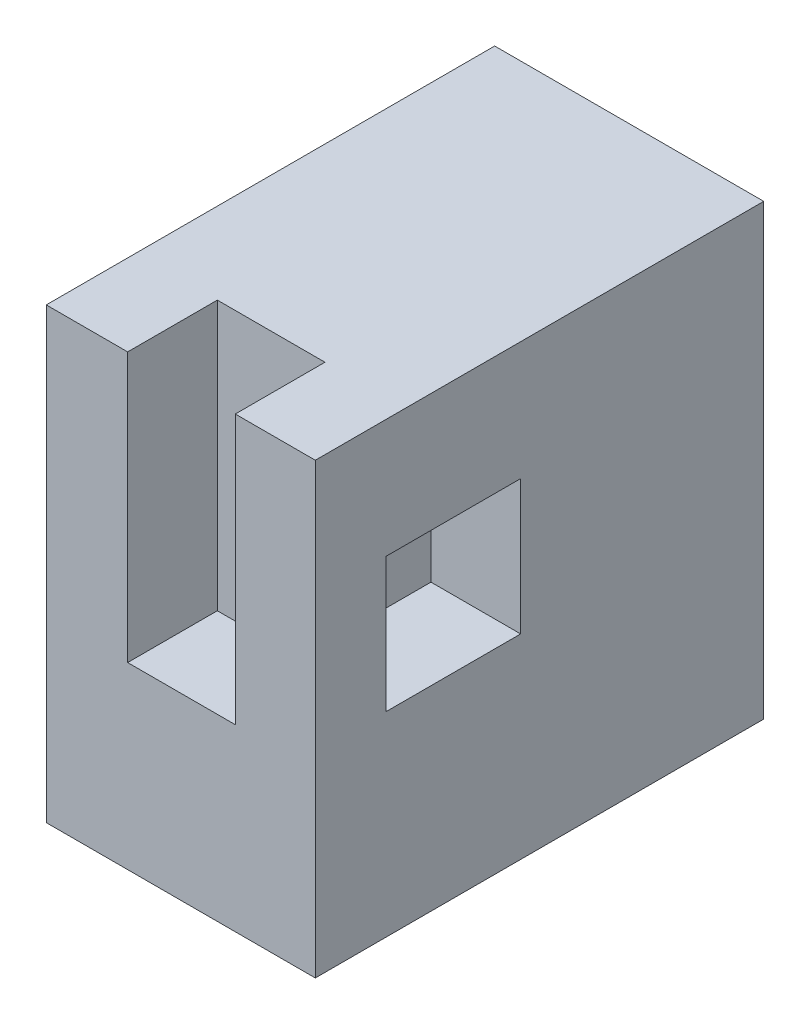
ISO-10303-21;
HEADER;
FILE_DESCRIPTION(('STEP AP214'),'2;1');
FILE_NAME('part.step','',(''),(''),'','','');
FILE_SCHEMA(('AUTOMOTIVE_DESIGN { 1 0 10303 214 1 1 1 1 }'));
ENDSEC;
DATA;
#1=APPLICATION_CONTEXT('core data for automotive mechanical design processes');
#2=APPLICATION_PROTOCOL_DEFINITION('international standard','automotive_design',2000,#1);
#3=PRODUCT_CONTEXT('',#1,'mechanical');
#4=PRODUCT('Part','Part','',(#3));
#5=PRODUCT_RELATED_PRODUCT_CATEGORY('part','',(#4));
#6=PRODUCT_DEFINITION_FORMATION('','',#4);
#7=PRODUCT_DEFINITION_CONTEXT('part definition',#1,'design');
#8=PRODUCT_DEFINITION('design','',#6,#7);
#9=PRODUCT_DEFINITION_SHAPE('','',#8);
#10=(LENGTH_UNIT() NAMED_UNIT(*) SI_UNIT(.MILLI.,.METRE.));
#11=(NAMED_UNIT(*) PLANE_ANGLE_UNIT() SI_UNIT($,.RADIAN.));
#12=(NAMED_UNIT(*) SI_UNIT($,.STERADIAN.) SOLID_ANGLE_UNIT());
#13=UNCERTAINTY_MEASURE_WITH_UNIT(LENGTH_MEASURE(1.E-05),#10,'distance_accuracy_value','');
#14=(GEOMETRIC_REPRESENTATION_CONTEXT(3) GLOBAL_UNCERTAINTY_ASSIGNED_CONTEXT((#13)) GLOBAL_UNIT_ASSIGNED_CONTEXT((#10,
#11,#12)) REPRESENTATION_CONTEXT('',''));
#15=CARTESIAN_POINT('',(0.,0.,0.));
#16=DIRECTION('',(0.,0.,1.));
#17=DIRECTION('',(1.,0.,0.));
#18=AXIS2_PLACEMENT_3D('',#15,#16,#17);
#19=CARTESIAN_POINT('',(-77.2402504992883,9.08860684769774,50.));
#20=DIRECTION('',(1.,0.,0.));
#21=DIRECTION('',(0.,1.,0.));
#22=AXIS2_PLACEMENT_3D('',#19,#20,#21);
#23=PLANE('',#22);
#24=DIRECTION('',(0.,-1.,0.));
#25=VECTOR('',#24,1.);
#26=CARTESIAN_POINT('',(-77.2402504992883,9.08860684769774,0.));
#27=LINE('',#26,#25);
#28=CARTESIAN_POINT('',(-77.2402504992883,9.08860684769774,0.));
#29=VERTEX_POINT('',#28);
#30=CARTESIAN_POINT('',(-77.2402504992883,-40.9113931523023,0.));
#31=VERTEX_POINT('',#30);
#32=EDGE_CURVE('E198',#29,#31,#27,.T.);
#33=ORIENTED_EDGE('',*,*,#32,.T.);
#34=DIRECTION('',(0.,0.,-1.));
#35=VECTOR('',#34,1.);
#36=CARTESIAN_POINT('',(-77.2402504992883,-40.9113931523023,50.));
#37=LINE('',#36,#35);
#38=CARTESIAN_POINT('',(-77.2402504992883,-40.9113931523023,50.));
#39=VERTEX_POINT('',#38);
#40=EDGE_CURVE('E234',#39,#31,#37,.T.);
#41=ORIENTED_EDGE('',*,*,#40,.F.);
#42=DIRECTION('',(0.,-1.,0.));
#43=VECTOR('',#42,1.);
#44=CARTESIAN_POINT('',(-77.2402504992883,9.08860684769774,50.));
#45=LINE('',#44,#43);
#46=CARTESIAN_POINT('',(-77.2402504992883,9.08860684769774,50.));
#47=VERTEX_POINT('',#46);
#48=EDGE_CURVE('E206',#47,#39,#45,.T.);
#49=ORIENTED_EDGE('',*,*,#48,.F.);
#50=DIRECTION('',(0.,0.,-1.));
#51=VECTOR('',#50,1.);
#52=CARTESIAN_POINT('',(-77.2402504992883,9.08860684769774,50.));
#53=LINE('',#52,#51);
#54=EDGE_CURVE('E218',#47,#29,#53,.T.);
#55=ORIENTED_EDGE('',*,*,#54,.T.);
#56=EDGE_LOOP('',(#33,#41,#49,#55));
#57=FACE_BOUND('',#56,.T.);
#58=ADVANCED_FACE('F33',(#57),#23,.F.);
#59=CARTESIAN_POINT('',(-77.2402504992883,-40.9113931523023,50.));
#60=DIRECTION('',(0.,1.,0.));
#61=DIRECTION('',(0.,0.,1.));
#62=AXIS2_PLACEMENT_3D('',#59,#60,#61);
#63=PLANE('',#62);
#64=DIRECTION('',(1.,0.,0.));
#65=VECTOR('',#64,1.);
#66=CARTESIAN_POINT('',(-77.2402504992883,-40.9113931523023,0.));
#67=LINE('',#66,#65);
#68=CARTESIAN_POINT('',(-47.2402504992883,-40.9113931523023,0.));
#69=VERTEX_POINT('',#68);
#70=EDGE_CURVE('E221',#31,#69,#67,.T.);
#71=ORIENTED_EDGE('',*,*,#70,.T.);
#72=DIRECTION('',(0.,0.,-1.));
#73=VECTOR('',#72,1.);
#74=CARTESIAN_POINT('',(-47.2402504992883,-40.9113931523023,50.));
#75=LINE('',#74,#73);
#76=CARTESIAN_POINT('',(-47.2402504992883,-40.9113931523023,50.));
#77=VERTEX_POINT('',#76);
#78=EDGE_CURVE('E231',#77,#69,#75,.T.);
#79=ORIENTED_EDGE('',*,*,#78,.F.);
#80=DIRECTION('',(1.,0.,0.));
#81=VECTOR('',#80,1.);
#82=CARTESIAN_POINT('',(-77.2402504992883,-40.9113931523023,50.));
#83=LINE('',#82,#81);
#84=EDGE_CURVE('E209',#39,#77,#83,.T.);
#85=ORIENTED_EDGE('',*,*,#84,.F.);
#86=ORIENTED_EDGE('',*,*,#40,.T.);
#87=EDGE_LOOP('',(#71,#79,#85,#86));
#88=FACE_BOUND('',#87,.T.);
#89=ADVANCED_FACE('F256',(#88),#63,.F.);
#90=CARTESIAN_POINT('',(-47.2402504992883,9.08860684769774,50.));
#91=DIRECTION('',(-1.,0.,0.));
#92=DIRECTION('',(0.,-1.,0.));
#93=AXIS2_PLACEMENT_3D('',#90,#91,#92);
#94=PLANE('',#93);
#95=DIRECTION('',(0.,0.,-1.));
#96=VECTOR('',#95,1.);
#97=CARTESIAN_POINT('',(-47.2402504992883,-19.1331208991699,42.1045266958799));
#98=LINE('',#97,#96);
#99=CARTESIAN_POINT('',(-47.2402504992883,-19.1331208991699,42.1045266958799));
#100=VERTEX_POINT('',#99);
#101=CARTESIAN_POINT('',(-47.2402504992883,-19.1331208991699,27.1045266958799));
#102=VERTEX_POINT('',#101);
#103=EDGE_CURVE('E148',#100,#102,#98,.T.);
#104=ORIENTED_EDGE('',*,*,#103,.F.);
#105=DIRECTION('',(0.,-1.,0.));
#106=VECTOR('',#105,1.);
#107=CARTESIAN_POINT('',(-47.2402504992883,-19.1331208991699,42.1045266958799));
#108=LINE('',#107,#106);
#109=CARTESIAN_POINT('',(-47.2402504992883,-4.13312089916987,42.1045266958799));
#110=VERTEX_POINT('',#109);
#111=EDGE_CURVE('E47',#110,#100,#108,.T.);
#112=ORIENTED_EDGE('',*,*,#111,.F.);
#113=DIRECTION('',(0.,0.,1.));
#114=VECTOR('',#113,1.);
#115=CARTESIAN_POINT('',(-47.2402504992883,-4.13312089916987,42.1045266958799));
#116=LINE('',#115,#114);
#117=CARTESIAN_POINT('',(-47.2402504992883,-4.13312089916987,27.1045266958799));
#118=VERTEX_POINT('',#117);
#119=EDGE_CURVE('E142',#118,#110,#116,.T.);
#120=ORIENTED_EDGE('',*,*,#119,.F.);
#121=DIRECTION('',(0.,1.,0.));
#122=VECTOR('',#121,1.);
#123=CARTESIAN_POINT('',(-47.2402504992883,-19.1331208991699,27.1045266958799));
#124=LINE('',#123,#122);
#125=EDGE_CURVE('E161',#102,#118,#124,.T.);
#126=ORIENTED_EDGE('',*,*,#125,.F.);
#127=EDGE_LOOP('',(#104,#112,#120,#126));
#128=FACE_BOUND('',#127,.T.);
#129=DIRECTION('',(0.,1.,0.));
#130=VECTOR('',#129,1.);
#131=CARTESIAN_POINT('',(-47.2402504992883,9.08860684769774,0.));
#132=LINE('',#131,#130);
#133=CARTESIAN_POINT('',(-47.2402504992883,9.08860684769774,0.));
#134=VERTEX_POINT('',#133);
#135=EDGE_CURVE('E223',#69,#134,#132,.T.);
#136=ORIENTED_EDGE('',*,*,#135,.T.);
#137=DIRECTION('',(0.,0.,-1.));
#138=VECTOR('',#137,1.);
#139=CARTESIAN_POINT('',(-47.2402504992883,9.08860684769774,50.));
#140=LINE('',#139,#138);
#141=CARTESIAN_POINT('',(-47.2402504992883,9.08860684769774,50.));
#142=VERTEX_POINT('',#141);
#143=EDGE_CURVE('E228',#142,#134,#140,.T.);
#144=ORIENTED_EDGE('',*,*,#143,.F.);
#145=DIRECTION('',(0.,1.,0.));
#146=VECTOR('',#145,1.);
#147=CARTESIAN_POINT('',(-47.2402504992883,9.08860684769774,50.));
#148=LINE('',#147,#146);
#149=EDGE_CURVE('E212',#77,#142,#148,.T.);
#150=ORIENTED_EDGE('',*,*,#149,.F.);
#151=ORIENTED_EDGE('',*,*,#78,.T.);
#152=EDGE_LOOP('',(#136,#144,#150,#151));
#153=FACE_BOUND('',#152,.T.);
#154=ADVANCED_FACE('F252',(#128,#153),#94,.F.);
#155=CARTESIAN_POINT('',(-77.2402504992883,9.08860684769774,50.));
#156=DIRECTION('',(0.,-1.,0.));
#157=DIRECTION('',(0.,0.,-1.));
#158=AXIS2_PLACEMENT_3D('',#155,#156,#157);
#159=PLANE('',#158);
#160=DIRECTION('',(-1.,0.,0.));
#161=VECTOR('',#160,1.);
#162=CARTESIAN_POINT('',(-77.2402504992883,9.08860684769774,50.));
#163=LINE('',#162,#161);
#164=CARTESIAN_POINT('',(-68.1652595936839,9.08860684769774,50.));
#165=VERTEX_POINT('',#164);
#166=EDGE_CURVE('E214',#165,#47,#163,.T.);
#167=ORIENTED_EDGE('',*,*,#166,.F.);
#168=DIRECTION('',(0.,0.,1.));
#169=VECTOR('',#168,1.);
#170=CARTESIAN_POINT('',(-68.1652595936839,9.08860684769774,40.));
#171=LINE('',#170,#169);
#172=CARTESIAN_POINT('',(-68.1652595936839,9.08860684769774,40.));
#173=VERTEX_POINT('',#172);
#174=EDGE_CURVE('E196',#173,#165,#171,.T.);
#175=ORIENTED_EDGE('',*,*,#174,.F.);
#176=DIRECTION('',(-1.,0.,0.));
#177=VECTOR('',#176,1.);
#178=CARTESIAN_POINT('',(-68.1652595936839,9.08860684769774,40.));
#179=LINE('',#178,#177);
#180=CARTESIAN_POINT('',(-56.1652595936839,9.08860684769774,40.));
#181=VERTEX_POINT('',#180);
#182=EDGE_CURVE('E187',#181,#173,#179,.T.);
#183=ORIENTED_EDGE('',*,*,#182,.F.);
#184=DIRECTION('',(0.,0.,1.));
#185=VECTOR('',#184,1.);
#186=CARTESIAN_POINT('',(-56.1652595936839,9.08860684769774,40.));
#187=LINE('',#186,#185);
#188=CARTESIAN_POINT('',(-56.1652595936839,9.08860684769774,50.));
#189=VERTEX_POINT('',#188);
#190=EDGE_CURVE('E199',#181,#189,#187,.T.);
#191=ORIENTED_EDGE('',*,*,#190,.T.);
#192=EDGE_CURVE('E215',#142,#189,#163,.T.);
#193=ORIENTED_EDGE('',*,*,#192,.F.);
#194=ORIENTED_EDGE('',*,*,#143,.T.);
#195=DIRECTION('',(-1.,0.,0.));
#196=VECTOR('',#195,1.);
#197=CARTESIAN_POINT('',(-77.2402504992883,9.08860684769774,0.));
#198=LINE('',#197,#196);
#199=EDGE_CURVE('E210',#134,#29,#198,.T.);
#200=ORIENTED_EDGE('',*,*,#199,.T.);
#201=ORIENTED_EDGE('',*,*,#54,.F.);
#202=EDGE_LOOP('',(#167,#175,#183,#191,#193,#194,#200,#201));
#203=FACE_BOUND('',#202,.T.);
#204=ADVANCED_FACE('F255',(#203),#159,.F.);
#205=CARTESIAN_POINT('',(0.,0.,50.));
#206=DIRECTION('',(0.,0.,1.));
#207=DIRECTION('',(1.,0.,0.));
#208=AXIS2_PLACEMENT_3D('',#205,#206,#207);
#209=PLANE('',#208);
#210=DIRECTION('',(0.,-1.,0.));
#211=VECTOR('',#210,1.);
#212=CARTESIAN_POINT('',(-68.1652595936839,9.08860684769774,50.));
#213=LINE('',#212,#211);
#214=CARTESIAN_POINT('',(-68.1652595936839,-20.9113931523023,50.));
#215=VERTEX_POINT('',#214);
#216=EDGE_CURVE('E175',#165,#215,#213,.T.);
#217=ORIENTED_EDGE('',*,*,#216,.F.);
#218=ORIENTED_EDGE('',*,*,#166,.T.);
#219=ORIENTED_EDGE('',*,*,#48,.T.);
#220=ORIENTED_EDGE('',*,*,#84,.T.);
#221=ORIENTED_EDGE('',*,*,#149,.T.);
#222=ORIENTED_EDGE('',*,*,#192,.T.);
#223=DIRECTION('',(0.,1.,0.));
#224=VECTOR('',#223,1.);
#225=CARTESIAN_POINT('',(-56.1652595936839,9.08860684769774,50.));
#226=LINE('',#225,#224);
#227=CARTESIAN_POINT('',(-56.1652595936839,-20.9113931523023,50.));
#228=VERTEX_POINT('',#227);
#229=EDGE_CURVE('E180',#228,#189,#226,.T.);
#230=ORIENTED_EDGE('',*,*,#229,.F.);
#231=DIRECTION('',(1.,0.,0.));
#232=VECTOR('',#231,1.);
#233=CARTESIAN_POINT('',(-68.1652595936839,-20.9113931523023,50.));
#234=LINE('',#233,#232);
#235=EDGE_CURVE('E192',#215,#228,#234,.T.);
#236=ORIENTED_EDGE('',*,*,#235,.F.);
#237=EDGE_LOOP('',(#217,#218,#219,#220,#221,#222,#230,#236));
#238=FACE_BOUND('',#237,.T.);
#239=ADVANCED_FACE('F277',(#238),#209,.T.);
#240=CARTESIAN_POINT('',(0.,0.,0.));
#241=DIRECTION('',(0.,0.,1.));
#242=DIRECTION('',(1.,0.,0.));
#243=AXIS2_PLACEMENT_3D('',#240,#241,#242);
#244=PLANE('',#243);
#245=ORIENTED_EDGE('',*,*,#32,.F.);
#246=ORIENTED_EDGE('',*,*,#199,.F.);
#247=ORIENTED_EDGE('',*,*,#135,.F.);
#248=ORIENTED_EDGE('',*,*,#70,.F.);
#249=EDGE_LOOP('',(#245,#246,#247,#248));
#250=FACE_BOUND('',#249,.T.);
#251=ADVANCED_FACE('F269',(#250),#244,.F.);
#252=CARTESIAN_POINT('',(-68.1652595936839,9.08860684769774,40.));
#253=DIRECTION('',(-1.,0.,0.));
#254=DIRECTION('',(0.,0.,1.));
#255=AXIS2_PLACEMENT_3D('',#252,#253,#254);
#256=PLANE('',#255);
#257=ORIENTED_EDGE('',*,*,#216,.T.);
#258=DIRECTION('',(0.,0.,1.));
#259=VECTOR('',#258,1.);
#260=CARTESIAN_POINT('',(-68.1652595936839,-20.9113931523023,40.));
#261=LINE('',#260,#259);
#262=CARTESIAN_POINT('',(-68.1652595936839,-20.9113931523023,40.));
#263=VERTEX_POINT('',#262);
#264=EDGE_CURVE('E190',#263,#215,#261,.T.);
#265=ORIENTED_EDGE('',*,*,#264,.F.);
#266=DIRECTION('',(0.,-1.,0.));
#267=VECTOR('',#266,1.);
#268=CARTESIAN_POINT('',(-68.1652595936839,9.08860684769774,40.));
#269=LINE('',#268,#267);
#270=EDGE_CURVE('E176',#173,#263,#269,.T.);
#271=ORIENTED_EDGE('',*,*,#270,.F.);
#272=ORIENTED_EDGE('',*,*,#174,.T.);
#273=EDGE_LOOP('',(#257,#265,#271,#272));
#274=FACE_BOUND('',#273,.T.);
#275=ADVANCED_FACE('F281',(#274),#256,.F.);
#276=CARTESIAN_POINT('',(-56.1652595936839,9.08860684769774,40.));
#277=DIRECTION('',(1.,0.,0.));
#278=DIRECTION('',(0.,0.,-1.));
#279=AXIS2_PLACEMENT_3D('',#276,#277,#278);
#280=PLANE('',#279);
#281=DIRECTION('',(0.,1.,0.));
#282=VECTOR('',#281,1.);
#283=CARTESIAN_POINT('',(-56.1652595936839,9.08860684769774,40.));
#284=LINE('',#283,#282);
#285=CARTESIAN_POINT('',(-56.1652595936839,-4.13312089916987,40.));
#286=VERTEX_POINT('',#285);
#287=EDGE_CURVE('E183',#286,#181,#284,.T.);
#288=ORIENTED_EDGE('',*,*,#287,.F.);
#289=DIRECTION('',(0.,0.,1.));
#290=VECTOR('',#289,1.);
#291=CARTESIAN_POINT('',(-56.1652595936839,-4.13312089916987,40.));
#292=LINE('',#291,#290);
#293=CARTESIAN_POINT('',(-56.1652595936839,-4.13312089916987,42.1045266958799));
#294=VERTEX_POINT('',#293);
#295=EDGE_CURVE('E172',#286,#294,#292,.T.);
#296=ORIENTED_EDGE('',*,*,#295,.T.);
#297=DIRECTION('',(0.,-1.,0.));
#298=VECTOR('',#297,1.);
#299=CARTESIAN_POINT('',(-56.1652595936839,9.08860684769774,42.1045266958799));
#300=LINE('',#299,#298);
#301=CARTESIAN_POINT('',(-56.1652595936839,-19.1331208991699,42.1045266958799));
#302=VERTEX_POINT('',#301);
#303=EDGE_CURVE('E11',#294,#302,#300,.T.);
#304=ORIENTED_EDGE('',*,*,#303,.T.);
#305=DIRECTION('',(0.,0.,-1.));
#306=VECTOR('',#305,1.);
#307=CARTESIAN_POINT('',(-56.1652595936839,-19.1331208991699,40.));
#308=LINE('',#307,#306);
#309=CARTESIAN_POINT('',(-56.1652595936839,-19.1331208991699,40.));
#310=VERTEX_POINT('',#309);
#311=EDGE_CURVE('E167',#302,#310,#308,.T.);
#312=ORIENTED_EDGE('',*,*,#311,.T.);
#313=CARTESIAN_POINT('',(-56.1652595936839,-20.9113931523023,40.));
#314=VERTEX_POINT('',#313);
#315=EDGE_CURVE('E184',#314,#310,#284,.T.);
#316=ORIENTED_EDGE('',*,*,#315,.F.);
#317=DIRECTION('',(0.,0.,1.));
#318=VECTOR('',#317,1.);
#319=CARTESIAN_POINT('',(-56.1652595936839,-20.9113931523023,40.));
#320=LINE('',#319,#318);
#321=EDGE_CURVE('E202',#314,#228,#320,.T.);
#322=ORIENTED_EDGE('',*,*,#321,.T.);
#323=ORIENTED_EDGE('',*,*,#229,.T.);
#324=ORIENTED_EDGE('',*,*,#190,.F.);
#325=EDGE_LOOP('',(#288,#296,#304,#312,#316,#322,#323,#324));
#326=FACE_BOUND('',#325,.T.);
#327=ADVANCED_FACE('F248',(#326),#280,.F.);
#328=CARTESIAN_POINT('',(-68.1652595936839,-20.9113931523023,40.));
#329=DIRECTION('',(0.,-1.,0.));
#330=DIRECTION('',(0.,0.,-1.));
#331=AXIS2_PLACEMENT_3D('',#328,#329,#330);
#332=PLANE('',#331);
#333=ORIENTED_EDGE('',*,*,#235,.T.);
#334=ORIENTED_EDGE('',*,*,#321,.F.);
#335=DIRECTION('',(1.,0.,0.));
#336=VECTOR('',#335,1.);
#337=CARTESIAN_POINT('',(-68.1652595936839,-20.9113931523023,40.));
#338=LINE('',#337,#336);
#339=EDGE_CURVE('E179',#263,#314,#338,.T.);
#340=ORIENTED_EDGE('',*,*,#339,.F.);
#341=ORIENTED_EDGE('',*,*,#264,.T.);
#342=EDGE_LOOP('',(#333,#334,#340,#341));
#343=FACE_BOUND('',#342,.T.);
#344=ADVANCED_FACE('F284',(#343),#332,.F.);
#345=CARTESIAN_POINT('',(0.,0.,40.));
#346=DIRECTION('',(0.,0.,1.));
#347=DIRECTION('',(1.,0.,0.));
#348=AXIS2_PLACEMENT_3D('',#345,#346,#347);
#349=PLANE('',#348);
#350=DIRECTION('',(-1.,0.,0.));
#351=VECTOR('',#350,1.);
#352=CARTESIAN_POINT('',(0.,-4.13312089916985,40.));
#353=LINE('',#352,#351);
#354=CARTESIAN_POINT('',(-57.2402504992883,-4.13312089916987,40.));
#355=VERTEX_POINT('',#354);
#356=EDGE_CURVE('E40',#286,#355,#353,.T.);
#357=ORIENTED_EDGE('',*,*,#356,.F.);
#358=ORIENTED_EDGE('',*,*,#287,.T.);
#359=ORIENTED_EDGE('',*,*,#182,.T.);
#360=ORIENTED_EDGE('',*,*,#270,.T.);
#361=ORIENTED_EDGE('',*,*,#339,.T.);
#362=ORIENTED_EDGE('',*,*,#315,.T.);
#363=DIRECTION('',(1.,0.,0.));
#364=VECTOR('',#363,1.);
#365=CARTESIAN_POINT('',(0.,-19.1331208991699,40.));
#366=LINE('',#365,#364);
#367=CARTESIAN_POINT('',(-57.2402504992883,-19.1331208991699,40.));
#368=VERTEX_POINT('',#367);
#369=EDGE_CURVE('E238',#368,#310,#366,.T.);
#370=ORIENTED_EDGE('',*,*,#369,.F.);
#371=DIRECTION('',(0.,-1.,0.));
#372=VECTOR('',#371,1.);
#373=CARTESIAN_POINT('',(-57.2402504992883,0.,40.));
#374=LINE('',#373,#372);
#375=EDGE_CURVE('E139',#355,#368,#374,.T.);
#376=ORIENTED_EDGE('',*,*,#375,.F.);
#377=EDGE_LOOP('',(#357,#358,#359,#360,#361,#362,#370,#376));
#378=FACE_BOUND('',#377,.T.);
#379=ADVANCED_FACE('F245',(#378),#349,.T.);
#380=CARTESIAN_POINT('',(-57.2402504992883,-19.1331208991699,42.1045266958799));
#381=DIRECTION('',(0.,0.,1.));
#382=DIRECTION('',(1.,0.,0.));
#383=AXIS2_PLACEMENT_3D('',#380,#381,#382);
#384=PLANE('',#383);
#385=DIRECTION('',(1.,0.,0.));
#386=VECTOR('',#385,1.);
#387=CARTESIAN_POINT('',(-57.2402504992883,-4.13312089916987,42.1045266958799));
#388=LINE('',#387,#386);
#389=EDGE_CURVE('E165',#294,#110,#388,.T.);
#390=ORIENTED_EDGE('',*,*,#389,.T.);
#391=ORIENTED_EDGE('',*,*,#111,.T.);
#392=DIRECTION('',(1.,0.,0.));
#393=VECTOR('',#392,1.);
#394=CARTESIAN_POINT('',(-57.2402504992883,-19.1331208991699,42.1045266958799));
#395=LINE('',#394,#393);
#396=EDGE_CURVE('E153',#302,#100,#395,.T.);
#397=ORIENTED_EDGE('',*,*,#396,.F.);
#398=ORIENTED_EDGE('',*,*,#303,.F.);
#399=EDGE_LOOP('',(#390,#391,#397,#398));
#400=FACE_BOUND('',#399,.T.);
#401=ADVANCED_FACE('F249',(#400),#384,.F.);
#402=CARTESIAN_POINT('',(-57.2402504992883,-4.13312089916987,42.1045266958799));
#403=DIRECTION('',(0.,1.,0.));
#404=DIRECTION('',(-1.,0.,0.));
#405=AXIS2_PLACEMENT_3D('',#402,#403,#404);
#406=PLANE('',#405);
#407=ORIENTED_EDGE('',*,*,#356,.T.);
#408=DIRECTION('',(0.,0.,1.));
#409=VECTOR('',#408,1.);
#410=CARTESIAN_POINT('',(-57.2402504992883,-4.13312089916987,42.1045266958799));
#411=LINE('',#410,#409);
#412=CARTESIAN_POINT('',(-57.2402504992883,-4.13312089916987,27.1045266958799));
#413=VERTEX_POINT('',#412);
#414=EDGE_CURVE('E55',#413,#355,#411,.T.);
#415=ORIENTED_EDGE('',*,*,#414,.F.);
#416=DIRECTION('',(1.,0.,0.));
#417=VECTOR('',#416,1.);
#418=CARTESIAN_POINT('',(-57.2402504992883,-4.13312089916987,27.1045266958799));
#419=LINE('',#418,#417);
#420=EDGE_CURVE('E152',#413,#118,#419,.T.);
#421=ORIENTED_EDGE('',*,*,#420,.T.);
#422=ORIENTED_EDGE('',*,*,#119,.T.);
#423=ORIENTED_EDGE('',*,*,#389,.F.);
#424=ORIENTED_EDGE('',*,*,#295,.F.);
#425=EDGE_LOOP('',(#407,#415,#421,#422,#423,#424));
#426=FACE_BOUND('',#425,.T.);
#427=ADVANCED_FACE('F241',(#426),#406,.F.);
#428=CARTESIAN_POINT('',(-57.2402504992883,-19.1331208991699,42.1045266958799));
#429=DIRECTION('',(0.,-1.,0.));
#430=DIRECTION('',(1.,0.,0.));
#431=AXIS2_PLACEMENT_3D('',#428,#429,#430);
#432=PLANE('',#431);
#433=ORIENTED_EDGE('',*,*,#396,.T.);
#434=ORIENTED_EDGE('',*,*,#103,.T.);
#435=DIRECTION('',(1.,0.,0.));
#436=VECTOR('',#435,1.);
#437=CARTESIAN_POINT('',(-57.2402504992883,-19.1331208991699,27.1045266958799));
#438=LINE('',#437,#436);
#439=CARTESIAN_POINT('',(-57.2402504992883,-19.1331208991699,27.1045266958799));
#440=VERTEX_POINT('',#439);
#441=EDGE_CURVE('E145',#440,#102,#438,.T.);
#442=ORIENTED_EDGE('',*,*,#441,.F.);
#443=DIRECTION('',(0.,0.,-1.));
#444=VECTOR('',#443,1.);
#445=CARTESIAN_POINT('',(-57.2402504992883,-19.1331208991699,42.1045266958799));
#446=LINE('',#445,#444);
#447=EDGE_CURVE('E133',#368,#440,#446,.T.);
#448=ORIENTED_EDGE('',*,*,#447,.F.);
#449=ORIENTED_EDGE('',*,*,#369,.T.);
#450=ORIENTED_EDGE('',*,*,#311,.F.);
#451=EDGE_LOOP('',(#433,#434,#442,#448,#449,#450));
#452=FACE_BOUND('',#451,.T.);
#453=ADVANCED_FACE('F146',(#452),#432,.F.);
#454=CARTESIAN_POINT('',(-57.2402504992883,-19.1331208991699,27.1045266958799));
#455=DIRECTION('',(0.,0.,-1.));
#456=DIRECTION('',(-1.,0.,0.));
#457=AXIS2_PLACEMENT_3D('',#454,#455,#456);
#458=PLANE('',#457);
#459=ORIENTED_EDGE('',*,*,#125,.T.);
#460=ORIENTED_EDGE('',*,*,#420,.F.);
#461=DIRECTION('',(0.,1.,0.));
#462=VECTOR('',#461,1.);
#463=CARTESIAN_POINT('',(-57.2402504992883,-19.1331208991699,27.1045266958799));
#464=LINE('',#463,#462);
#465=EDGE_CURVE('E137',#440,#413,#464,.T.);
#466=ORIENTED_EDGE('',*,*,#465,.F.);
#467=ORIENTED_EDGE('',*,*,#441,.T.);
#468=EDGE_LOOP('',(#459,#460,#466,#467));
#469=FACE_BOUND('',#468,.T.);
#470=ADVANCED_FACE('F155',(#469),#458,.F.);
#471=CARTESIAN_POINT('',(-57.2402504992883,0.,0.));
#472=DIRECTION('',(-1.,0.,0.));
#473=DIRECTION('',(0.,-1.,0.));
#474=AXIS2_PLACEMENT_3D('',#471,#472,#473);
#475=PLANE('',#474);
#476=ORIENTED_EDGE('',*,*,#375,.T.);
#477=ORIENTED_EDGE('',*,*,#447,.T.);
#478=ORIENTED_EDGE('',*,*,#465,.T.);
#479=ORIENTED_EDGE('',*,*,#414,.T.);
#480=EDGE_LOOP('',(#476,#477,#478,#479));
#481=FACE_BOUND('',#480,.T.);
#482=ADVANCED_FACE('F135',(#481),#475,.F.);
#483=CLOSED_SHELL('',(#58,#89,#154,#204,#239,#251,#275,#327,#344,#379,#401,#427,#453,#470,#482));
#484=MANIFOLD_SOLID_BREP('B2',#483);
#485=ADVANCED_BREP_SHAPE_REPRESENTATION('',(#18,#484),#14);
#486=SHAPE_DEFINITION_REPRESENTATION(#9,#485);
ENDSEC;
END-ISO-10303-21;
